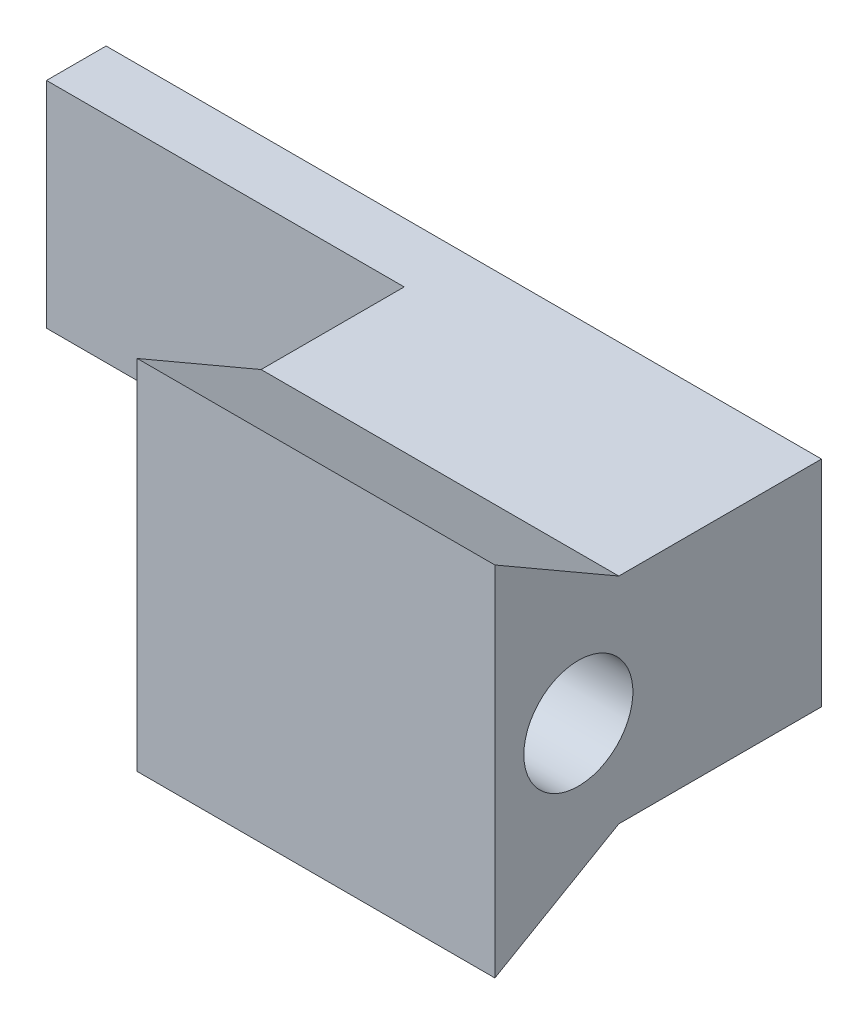
ISO-10303-21;
HEADER;
FILE_DESCRIPTION(('STEP AP214'),'2;1');
FILE_NAME('part.step','',(''),(''),'','','');
FILE_SCHEMA(('AUTOMOTIVE_DESIGN { 1 0 10303 214 1 1 1 1 }'));
ENDSEC;
DATA;
#1=APPLICATION_CONTEXT('core data for automotive mechanical design processes');
#2=APPLICATION_PROTOCOL_DEFINITION('international standard','automotive_design',2000,#1);
#3=PRODUCT_CONTEXT('',#1,'mechanical');
#4=PRODUCT('Part','Part','',(#3));
#5=PRODUCT_RELATED_PRODUCT_CATEGORY('part','',(#4));
#6=PRODUCT_DEFINITION_FORMATION('','',#4);
#7=PRODUCT_DEFINITION_CONTEXT('part definition',#1,'design');
#8=PRODUCT_DEFINITION('design','',#6,#7);
#9=PRODUCT_DEFINITION_SHAPE('','',#8);
#10=(LENGTH_UNIT() NAMED_UNIT(*) SI_UNIT(.MILLI.,.METRE.));
#11=(NAMED_UNIT(*) PLANE_ANGLE_UNIT() SI_UNIT($,.RADIAN.));
#12=(NAMED_UNIT(*) SI_UNIT($,.STERADIAN.) SOLID_ANGLE_UNIT());
#13=UNCERTAINTY_MEASURE_WITH_UNIT(LENGTH_MEASURE(1.E-05),#10,'distance_accuracy_value','');
#14=(GEOMETRIC_REPRESENTATION_CONTEXT(3) GLOBAL_UNCERTAINTY_ASSIGNED_CONTEXT((#13)) GLOBAL_UNIT_ASSIGNED_CONTEXT((#10,
#11,#12)) REPRESENTATION_CONTEXT('',''));
#15=CARTESIAN_POINT('',(0.,0.,0.));
#16=DIRECTION('',(0.,0.,1.));
#17=DIRECTION('',(1.,0.,0.));
#18=AXIS2_PLACEMENT_3D('',#15,#16,#17);
#19=CARTESIAN_POINT('',(0.,0.,0.));
#20=DIRECTION('',(1.,0.,0.));
#21=DIRECTION('',(0.,0.,-1.));
#22=AXIS2_PLACEMENT_3D('',#19,#20,#21);
#23=PLANE('',#22);
#24=CARTESIAN_POINT('',(0.,0.,-0.7));
#25=DIRECTION('',(-1.,0.,0.));
#26=DIRECTION('',(0.,0.,1.));
#27=AXIS2_PLACEMENT_3D('',#24,#25,#26);
#28=CIRCLE('',#27,0.4572);
#29=CARTESIAN_POINT('',(0.,0.,-0.2428));
#30=VERTEX_POINT('',#29);
#31=EDGE_CURVE('E199',#30,#30,#28,.T.);
#32=ORIENTED_EDGE('',*,*,#31,.F.);
#33=EDGE_LOOP('',(#32));
#34=FACE_BOUND('',#33,.T.);
#35=DIRECTION('',(0.,1.,0.));
#36=VECTOR('',#35,1.);
#37=CARTESIAN_POINT('',(0.,0.,-2.23923048454132));
#38=LINE('',#37,#36);
#39=CARTESIAN_POINT('',(0.,-0.900000000000001,-2.23923048454131));
#40=VERTEX_POINT('',#39);
#41=CARTESIAN_POINT('',(0.,0.899999999999999,-2.23923048454132));
#42=VERTEX_POINT('',#41);
#43=EDGE_CURVE('E59',#40,#42,#38,.T.);
#44=ORIENTED_EDGE('',*,*,#43,.F.);
#45=DIRECTION('',(0.,0.,-1.));
#46=VECTOR('',#45,1.);
#47=CARTESIAN_POINT('',(0.,-0.900000000000001,0.));
#48=LINE('',#47,#46);
#49=CARTESIAN_POINT('',(0.,-0.900000000000001,-1.03923048454131));
#50=VERTEX_POINT('',#49);
#51=EDGE_CURVE('E137',#50,#40,#48,.T.);
#52=ORIENTED_EDGE('',*,*,#51,.F.);
#53=DIRECTION('',(0.,-0.500000000000004,0.866025403784436));
#54=VECTOR('',#53,1.);
#55=CARTESIAN_POINT('',(0.,-1.12499999999999,-0.649519052838333));
#56=LINE('',#55,#54);
#57=CARTESIAN_POINT('',(0.,-1.5,0.));
#58=VERTEX_POINT('',#57);
#59=EDGE_CURVE('E149',#50,#58,#56,.T.);
#60=ORIENTED_EDGE('',*,*,#59,.T.);
#61=DIRECTION('',(0.,1.,0.));
#62=VECTOR('',#61,1.);
#63=CARTESIAN_POINT('',(0.,0.,0.));
#64=LINE('',#63,#62);
#65=CARTESIAN_POINT('',(0.,1.5,0.));
#66=VERTEX_POINT('',#65);
#67=EDGE_CURVE('E146',#58,#66,#64,.T.);
#68=ORIENTED_EDGE('',*,*,#67,.T.);
#69=DIRECTION('',(0.,-0.500000000000005,-0.866025403784436));
#70=VECTOR('',#69,1.);
#71=CARTESIAN_POINT('',(0.,1.12499999999999,-0.649519052838333));
#72=LINE('',#71,#70);
#73=CARTESIAN_POINT('',(0.,0.899999999999999,-1.03923048454132));
#74=VERTEX_POINT('',#73);
#75=EDGE_CURVE('E112',#66,#74,#72,.T.);
#76=ORIENTED_EDGE('',*,*,#75,.T.);
#77=DIRECTION('',(0.,0.,-1.));
#78=VECTOR('',#77,1.);
#79=CARTESIAN_POINT('',(0.,0.899999999999999,0.));
#80=LINE('',#79,#78);
#81=EDGE_CURVE('E140',#74,#42,#80,.T.);
#82=ORIENTED_EDGE('',*,*,#81,.T.);
#83=EDGE_LOOP('',(#44,#52,#60,#68,#76,#82));
#84=FACE_BOUND('',#83,.T.);
#85=ADVANCED_FACE('F43',(#34,#84),#23,.F.);
#86=CARTESIAN_POINT('',(3.,-0.900000000000001,0.));
#87=DIRECTION('',(0.,1.,0.));
#88=DIRECTION('',(0.,0.,1.));
#89=AXIS2_PLACEMENT_3D('',#86,#87,#88);
#90=PLANE('',#89);
#91=ORIENTED_EDGE('',*,*,#51,.T.);
#92=DIRECTION('',(1.,0.,0.));
#93=VECTOR('',#92,1.);
#94=CARTESIAN_POINT('',(-3.,-0.900000000000001,-2.23923048454131));
#95=LINE('',#94,#93);
#96=CARTESIAN_POINT('',(-3.,-0.900000000000001,-2.23923048454131));
#97=VERTEX_POINT('',#96);
#98=EDGE_CURVE('E188',#97,#40,#95,.T.);
#99=ORIENTED_EDGE('',*,*,#98,.F.);
#100=DIRECTION('',(0.,0.,1.));
#101=VECTOR('',#100,1.);
#102=CARTESIAN_POINT('',(-3.,-0.900000000000005,0.));
#103=LINE('',#102,#101);
#104=CARTESIAN_POINT('',(-3.,-0.9,-2.73923048454132));
#105=VERTEX_POINT('',#104);
#106=EDGE_CURVE('E180',#105,#97,#103,.T.);
#107=ORIENTED_EDGE('',*,*,#106,.F.);
#108=DIRECTION('',(-1.,0.,0.));
#109=VECTOR('',#108,1.);
#110=CARTESIAN_POINT('',(3.,-0.9,-2.73923048454132));
#111=LINE('',#110,#109);
#112=CARTESIAN_POINT('',(3.,-0.9,-2.73923048454132));
#113=VERTEX_POINT('',#112);
#114=EDGE_CURVE('E11',#113,#105,#111,.T.);
#115=ORIENTED_EDGE('',*,*,#114,.F.);
#116=DIRECTION('',(0.,0.,-1.));
#117=VECTOR('',#116,1.);
#118=CARTESIAN_POINT('',(3.,-0.900000000000001,0.));
#119=LINE('',#118,#117);
#120=CARTESIAN_POINT('',(3.,-0.900000000000001,-1.03923048454131));
#121=VERTEX_POINT('',#120);
#122=EDGE_CURVE('E93',#121,#113,#119,.T.);
#123=ORIENTED_EDGE('',*,*,#122,.F.);
#124=DIRECTION('',(-1.,0.,0.));
#125=VECTOR('',#124,1.);
#126=CARTESIAN_POINT('',(3.,-0.900000000000001,-1.03923048454131));
#127=LINE('',#126,#125);
#128=EDGE_CURVE('E68',#121,#50,#127,.T.);
#129=ORIENTED_EDGE('',*,*,#128,.T.);
#130=EDGE_LOOP('',(#91,#99,#107,#115,#123,#129));
#131=FACE_BOUND('',#130,.T.);
#132=ADVANCED_FACE('F45',(#131),#90,.F.);
#133=CARTESIAN_POINT('',(3.,0.,-2.73923048454132));
#134=DIRECTION('',(0.,0.,-1.));
#135=DIRECTION('',(0.,1.,0.));
#136=AXIS2_PLACEMENT_3D('',#133,#134,#135);
#137=PLANE('',#136);
#138=ORIENTED_EDGE('',*,*,#114,.T.);
#139=DIRECTION('',(0.,-1.,0.));
#140=VECTOR('',#139,1.);
#141=CARTESIAN_POINT('',(-3.,0.,-2.73923048454132));
#142=LINE('',#141,#140);
#143=CARTESIAN_POINT('',(-3.,0.9,-2.73923048454132));
#144=VERTEX_POINT('',#143);
#145=EDGE_CURVE('E174',#144,#105,#142,.T.);
#146=ORIENTED_EDGE('',*,*,#145,.F.);
#147=DIRECTION('',(-1.,0.,0.));
#148=VECTOR('',#147,1.);
#149=CARTESIAN_POINT('',(3.,0.9,-2.73923048454132));
#150=LINE('',#149,#148);
#151=CARTESIAN_POINT('',(3.,0.9,-2.73923048454132));
#152=VERTEX_POINT('',#151);
#153=EDGE_CURVE('E52',#152,#144,#150,.T.);
#154=ORIENTED_EDGE('',*,*,#153,.F.);
#155=DIRECTION('',(0.,-1.,0.));
#156=VECTOR('',#155,1.);
#157=CARTESIAN_POINT('',(3.,0.,-2.73923048454132));
#158=LINE('',#157,#156);
#159=EDGE_CURVE('E209',#152,#113,#158,.T.);
#160=ORIENTED_EDGE('',*,*,#159,.T.);
#161=EDGE_LOOP('',(#138,#146,#154,#160));
#162=FACE_BOUND('',#161,.T.);
#163=ADVANCED_FACE('F175',(#162),#137,.T.);
#164=CARTESIAN_POINT('',(3.,0.899999999999999,0.));
#165=DIRECTION('',(0.,1.,0.));
#166=DIRECTION('',(0.,0.,1.));
#167=AXIS2_PLACEMENT_3D('',#164,#165,#166);
#168=PLANE('',#167);
#169=ORIENTED_EDGE('',*,*,#81,.F.);
#170=DIRECTION('',(-1.,0.,0.));
#171=VECTOR('',#170,1.);
#172=CARTESIAN_POINT('',(3.,0.899999999999999,-1.03923048454132));
#173=LINE('',#172,#171);
#174=CARTESIAN_POINT('',(3.,0.899999999999999,-1.03923048454132));
#175=VERTEX_POINT('',#174);
#176=EDGE_CURVE('E118',#175,#74,#173,.T.);
#177=ORIENTED_EDGE('',*,*,#176,.F.);
#178=DIRECTION('',(0.,0.,-1.));
#179=VECTOR('',#178,1.);
#180=CARTESIAN_POINT('',(3.,0.899999999999999,0.));
#181=LINE('',#180,#179);
#182=EDGE_CURVE('E126',#175,#152,#181,.T.);
#183=ORIENTED_EDGE('',*,*,#182,.T.);
#184=ORIENTED_EDGE('',*,*,#153,.T.);
#185=DIRECTION('',(0.,0.,1.));
#186=VECTOR('',#185,1.);
#187=CARTESIAN_POINT('',(-3.,0.899999999999996,0.));
#188=LINE('',#187,#186);
#189=CARTESIAN_POINT('',(-3.,0.899999999999999,-2.23923048454132));
#190=VERTEX_POINT('',#189);
#191=EDGE_CURVE('E168',#144,#190,#188,.T.);
#192=ORIENTED_EDGE('',*,*,#191,.T.);
#193=DIRECTION('',(1.,0.,0.));
#194=VECTOR('',#193,1.);
#195=CARTESIAN_POINT('',(-3.,0.899999999999999,-2.23923048454132));
#196=LINE('',#195,#194);
#197=EDGE_CURVE('E192',#190,#42,#196,.T.);
#198=ORIENTED_EDGE('',*,*,#197,.T.);
#199=EDGE_LOOP('',(#169,#177,#183,#184,#192,#198));
#200=FACE_BOUND('',#199,.T.);
#201=ADVANCED_FACE('F165',(#200),#168,.T.);
#202=CARTESIAN_POINT('',(3.,1.12499999999999,-0.649519052838333));
#203=DIRECTION('',(0.,0.866025403784436,-0.500000000000004));
#204=DIRECTION('',(0.,0.500000000000004,0.866025403784436));
#205=AXIS2_PLACEMENT_3D('',#202,#203,#204);
#206=PLANE('',#205);
#207=ORIENTED_EDGE('',*,*,#75,.F.);
#208=DIRECTION('',(-1.,0.,0.));
#209=VECTOR('',#208,1.);
#210=CARTESIAN_POINT('',(3.,1.5,0.));
#211=LINE('',#210,#209);
#212=CARTESIAN_POINT('',(3.,1.5,0.));
#213=VERTEX_POINT('',#212);
#214=EDGE_CURVE('E107',#213,#66,#211,.T.);
#215=ORIENTED_EDGE('',*,*,#214,.F.);
#216=DIRECTION('',(0.,-0.500000000000005,-0.866025403784436));
#217=VECTOR('',#216,1.);
#218=CARTESIAN_POINT('',(3.,1.12499999999999,-0.649519052838333));
#219=LINE('',#218,#217);
#220=EDGE_CURVE('E110',#213,#175,#219,.T.);
#221=ORIENTED_EDGE('',*,*,#220,.T.);
#222=ORIENTED_EDGE('',*,*,#176,.T.);
#223=EDGE_LOOP('',(#207,#215,#221,#222));
#224=FACE_BOUND('',#223,.T.);
#225=ADVANCED_FACE('F109',(#224),#206,.T.);
#226=CARTESIAN_POINT('',(3.,0.,0.));
#227=DIRECTION('',(0.,0.,1.));
#228=DIRECTION('',(0.,-1.,0.));
#229=AXIS2_PLACEMENT_3D('',#226,#227,#228);
#230=PLANE('',#229);
#231=ORIENTED_EDGE('',*,*,#67,.F.);
#232=DIRECTION('',(-1.,0.,0.));
#233=VECTOR('',#232,1.);
#234=CARTESIAN_POINT('',(3.,-1.5,0.));
#235=LINE('',#234,#233);
#236=CARTESIAN_POINT('',(3.,-1.5,0.));
#237=VERTEX_POINT('',#236);
#238=EDGE_CURVE('E119',#237,#58,#235,.T.);
#239=ORIENTED_EDGE('',*,*,#238,.F.);
#240=DIRECTION('',(0.,1.,0.));
#241=VECTOR('',#240,1.);
#242=CARTESIAN_POINT('',(3.,0.,0.));
#243=LINE('',#242,#241);
#244=EDGE_CURVE('E124',#237,#213,#243,.T.);
#245=ORIENTED_EDGE('',*,*,#244,.T.);
#246=ORIENTED_EDGE('',*,*,#214,.T.);
#247=EDGE_LOOP('',(#231,#239,#245,#246));
#248=FACE_BOUND('',#247,.T.);
#249=ADVANCED_FACE('F129',(#248),#230,.T.);
#250=CARTESIAN_POINT('',(3.,-1.12499999999999,-0.649519052838333));
#251=DIRECTION('',(0.,-0.866025403784436,-0.500000000000004));
#252=DIRECTION('',(0.,0.500000000000004,-0.866025403784436));
#253=AXIS2_PLACEMENT_3D('',#250,#251,#252);
#254=PLANE('',#253);
#255=ORIENTED_EDGE('',*,*,#59,.F.);
#256=ORIENTED_EDGE('',*,*,#128,.F.);
#257=DIRECTION('',(0.,-0.500000000000004,0.866025403784436));
#258=VECTOR('',#257,1.);
#259=CARTESIAN_POINT('',(3.,-1.12499999999999,-0.649519052838333));
#260=LINE('',#259,#258);
#261=EDGE_CURVE('E131',#121,#237,#260,.T.);
#262=ORIENTED_EDGE('',*,*,#261,.T.);
#263=ORIENTED_EDGE('',*,*,#238,.T.);
#264=EDGE_LOOP('',(#255,#256,#262,#263));
#265=FACE_BOUND('',#264,.T.);
#266=ADVANCED_FACE('F229',(#265),#254,.T.);
#267=CARTESIAN_POINT('',(3.,0.,0.));
#268=DIRECTION('',(1.,0.,0.));
#269=DIRECTION('',(0.,0.,-1.));
#270=AXIS2_PLACEMENT_3D('',#267,#268,#269);
#271=PLANE('',#270);
#272=CARTESIAN_POINT('',(3.,0.,-0.7));
#273=DIRECTION('',(-1.,0.,0.));
#274=DIRECTION('',(0.,0.,1.));
#275=AXIS2_PLACEMENT_3D('',#272,#273,#274);
#276=CIRCLE('',#275,0.457199999999999);
#277=CARTESIAN_POINT('',(3.,0.,-0.242800000000001));
#278=VERTEX_POINT('',#277);
#279=EDGE_CURVE('E141',#278,#278,#276,.T.);
#280=ORIENTED_EDGE('',*,*,#279,.T.);
#281=EDGE_LOOP('',(#280));
#282=FACE_BOUND('',#281,.T.);
#283=ORIENTED_EDGE('',*,*,#122,.T.);
#284=ORIENTED_EDGE('',*,*,#159,.F.);
#285=ORIENTED_EDGE('',*,*,#182,.F.);
#286=ORIENTED_EDGE('',*,*,#220,.F.);
#287=ORIENTED_EDGE('',*,*,#244,.F.);
#288=ORIENTED_EDGE('',*,*,#261,.F.);
#289=EDGE_LOOP('',(#283,#284,#285,#286,#287,#288));
#290=FACE_BOUND('',#289,.T.);
#291=ADVANCED_FACE('F123',(#282,#290),#271,.T.);
#292=CARTESIAN_POINT('',(0.,0.,-0.7));
#293=DIRECTION('',(-1.,0.,0.));
#294=DIRECTION('',(0.,0.,1.));
#295=AXIS2_PLACEMENT_3D('',#292,#293,#294);
#296=CYLINDRICAL_SURFACE('',#295,0.457199999999999);
#297=ORIENTED_EDGE('',*,*,#279,.F.);
#298=EDGE_LOOP('',(#297));
#299=FACE_BOUND('',#298,.T.);
#300=ORIENTED_EDGE('',*,*,#31,.T.);
#301=EDGE_LOOP('',(#300));
#302=FACE_BOUND('',#301,.T.);
#303=ADVANCED_FACE('F215',(#299,#302),#296,.F.);
#304=CARTESIAN_POINT('',(-3.,0.,-2.23923048454132));
#305=DIRECTION('',(0.,0.,-1.));
#306=DIRECTION('',(-1.,0.,0.));
#307=AXIS2_PLACEMENT_3D('',#304,#305,#306);
#308=PLANE('',#307);
#309=ORIENTED_EDGE('',*,*,#43,.T.);
#310=ORIENTED_EDGE('',*,*,#197,.F.);
#311=DIRECTION('',(0.,1.,0.));
#312=VECTOR('',#311,1.);
#313=CARTESIAN_POINT('',(-3.,0.,-2.23923048454132));
#314=LINE('',#313,#312);
#315=EDGE_CURVE('E185',#97,#190,#314,.T.);
#316=ORIENTED_EDGE('',*,*,#315,.F.);
#317=ORIENTED_EDGE('',*,*,#98,.T.);
#318=EDGE_LOOP('',(#309,#310,#316,#317));
#319=FACE_BOUND('',#318,.T.);
#320=ADVANCED_FACE('F218',(#319),#308,.F.);
#321=CARTESIAN_POINT('',(-3.,0.,0.));
#322=DIRECTION('',(1.,0.,0.));
#323=DIRECTION('',(0.,0.,-1.));
#324=AXIS2_PLACEMENT_3D('',#321,#322,#323);
#325=PLANE('',#324);
#326=ORIENTED_EDGE('',*,*,#315,.T.);
#327=ORIENTED_EDGE('',*,*,#191,.F.);
#328=ORIENTED_EDGE('',*,*,#145,.T.);
#329=ORIENTED_EDGE('',*,*,#106,.T.);
#330=EDGE_LOOP('',(#326,#327,#328,#329));
#331=FACE_BOUND('',#330,.T.);
#332=ADVANCED_FACE('F183',(#331),#325,.F.);
#333=CLOSED_SHELL('',(#85,#132,#163,#201,#225,#249,#266,#291,#303,#320,#332));
#334=MANIFOLD_SOLID_BREP('B2',#333);
#335=ADVANCED_BREP_SHAPE_REPRESENTATION('',(#18,#334),#14);
#336=SHAPE_DEFINITION_REPRESENTATION(#9,#335);
ENDSEC;
END-ISO-10303-21;
